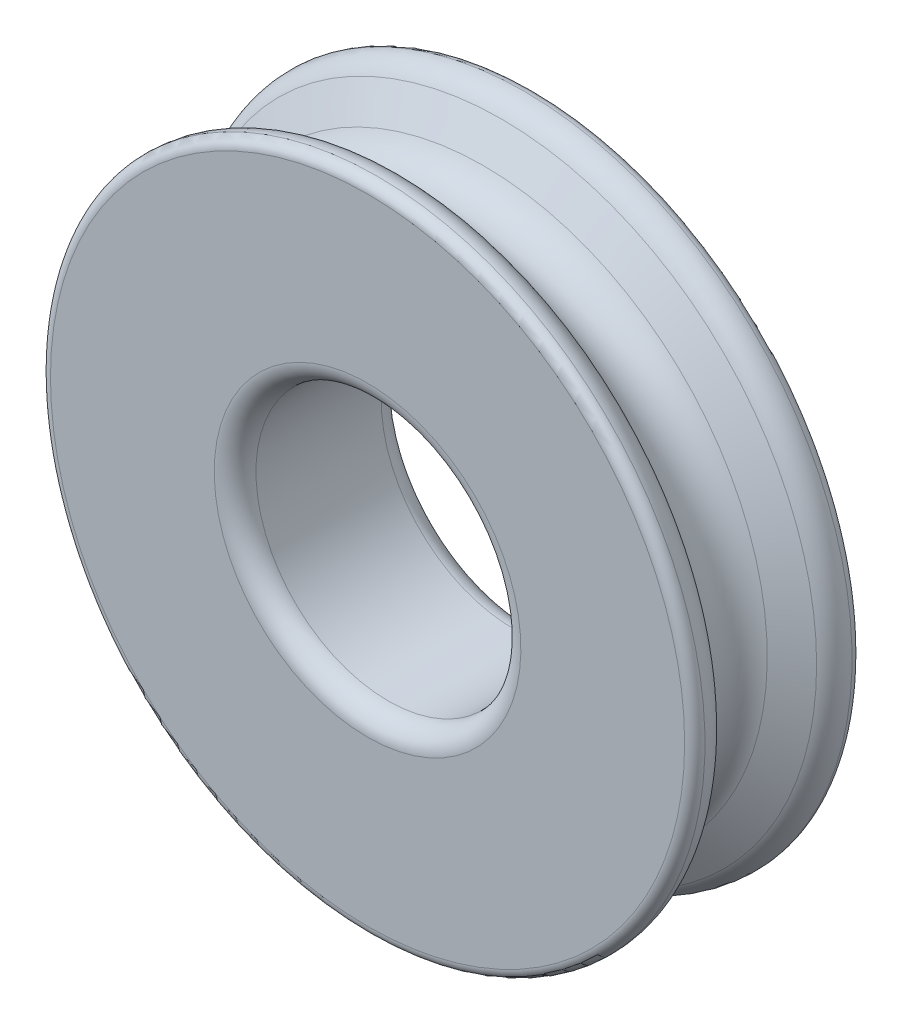
ISO-10303-21;
HEADER;
FILE_DESCRIPTION(('STEP AP214'),'2;1');
FILE_NAME('part.step','',(''),(''),'','','');
FILE_SCHEMA(('AUTOMOTIVE_DESIGN { 1 0 10303 214 1 1 1 1 }'));
ENDSEC;
DATA;
#1=APPLICATION_CONTEXT('core data for automotive mechanical design processes');
#2=APPLICATION_PROTOCOL_DEFINITION('international standard','automotive_design',2000,#1);
#3=PRODUCT_CONTEXT('',#1,'mechanical');
#4=PRODUCT('Part','Part','',(#3));
#5=PRODUCT_RELATED_PRODUCT_CATEGORY('part','',(#4));
#6=PRODUCT_DEFINITION_FORMATION('','',#4);
#7=PRODUCT_DEFINITION_CONTEXT('part definition',#1,'design');
#8=PRODUCT_DEFINITION('design','',#6,#7);
#9=PRODUCT_DEFINITION_SHAPE('','',#8);
#10=(LENGTH_UNIT() NAMED_UNIT(*) SI_UNIT(.MILLI.,.METRE.));
#11=(NAMED_UNIT(*) PLANE_ANGLE_UNIT() SI_UNIT($,.RADIAN.));
#12=(NAMED_UNIT(*) SI_UNIT($,.STERADIAN.) SOLID_ANGLE_UNIT());
#13=UNCERTAINTY_MEASURE_WITH_UNIT(LENGTH_MEASURE(1.E-05),#10,'distance_accuracy_value','');
#14=(GEOMETRIC_REPRESENTATION_CONTEXT(3) GLOBAL_UNCERTAINTY_ASSIGNED_CONTEXT((#13)) GLOBAL_UNIT_ASSIGNED_CONTEXT((#10,
#11,#12)) REPRESENTATION_CONTEXT('',''));
#15=CARTESIAN_POINT('',(0.,0.,0.));
#16=DIRECTION('',(0.,0.,1.));
#17=DIRECTION('',(1.,0.,0.));
#18=AXIS2_PLACEMENT_3D('',#15,#16,#17);
#19=CARTESIAN_POINT('',(0.,0.,-3.5000057));
#20=DIRECTION('',(0.,0.,-1.));
#21=DIRECTION('',(0.,1.,0.));
#22=AXIS2_PLACEMENT_3D('',#19,#20,#21);
#23=TOROIDAL_SURFACE('',#22,15.2006219074877,0.499999000000001);
#24=CARTESIAN_POINT('',(0.,0.,-3.52503594612087));
#25=DIRECTION('',(0.,0.,-1.));
#26=DIRECTION('',(0.,1.,0.));
#27=AXIS2_PLACEMENT_3D('',#24,#25,#26);
#28=CIRCLE('',#27,15.699994);
#29=CARTESIAN_POINT('',(0.,15.699994,-3.52503594612087));
#30=VERTEX_POINT('',#29);
#31=EDGE_CURVE('E53',#30,#30,#28,.T.);
#32=ORIENTED_EDGE('',*,*,#31,.T.);
#33=EDGE_LOOP('',(#32));
#34=FACE_BOUND('',#33,.T.);
#35=CARTESIAN_POINT('',(0.,0.,-4.0000047));
#36=DIRECTION('',(0.,0.,-1.));
#37=DIRECTION('',(0.,1.,0.));
#38=AXIS2_PLACEMENT_3D('',#35,#36,#37);
#39=CIRCLE('',#38,15.2006219074877);
#40=CARTESIAN_POINT('',(0.,15.2006219074877,-4.0000047));
#41=VERTEX_POINT('',#40);
#42=EDGE_CURVE('E74',#41,#41,#39,.T.);
#43=ORIENTED_EDGE('',*,*,#42,.F.);
#44=EDGE_LOOP('',(#43));
#45=FACE_BOUND('',#44,.T.);
#46=ADVANCED_FACE('F33',(#34,#45),#23,.T.);
#47=CARTESIAN_POINT('',(0.,0.,-3.46496335543078));
#48=DIRECTION('',(0.,0.,-1.));
#49=DIRECTION('',(0.,1.,0.));
#50=AXIS2_PLACEMENT_3D('',#47,#48,#49);
#51=TOROIDAL_SURFACE('',#50,14.5015009779704,1.1999976);
#52=CARTESIAN_POINT('',(0.,0.,-2.42573494935043));
#53=DIRECTION('',(0.,0.,-1.));
#54=DIRECTION('',(0.,1.,0.));
#55=AXIS2_PLACEMENT_3D('',#52,#53,#54);
#56=CIRCLE('',#55,15.1014997779704);
#57=CARTESIAN_POINT('',(0.,15.1014997779704,-2.42573494935042));
#58=VERTEX_POINT('',#57);
#59=EDGE_CURVE('E56',#58,#58,#56,.T.);
#60=ORIENTED_EDGE('',*,*,#59,.T.);
#61=EDGE_LOOP('',(#60));
#62=FACE_BOUND('',#61,.T.);
#63=ORIENTED_EDGE('',*,*,#31,.F.);
#64=EDGE_LOOP('',(#63));
#65=FACE_BOUND('',#64,.T.);
#66=ADVANCED_FACE('F81',(#62,#65),#51,.T.);
#67=CARTESIAN_POINT('',(0.,0.,-2.42573494935043));
#68=DIRECTION('',(0.,0.,-1.));
#69=DIRECTION('',(0.,1.,0.));
#70=AXIS2_PLACEMENT_3D('',#67,#68,#69);
#71=CONICAL_SURFACE('',#70,15.1014997779704,1.0471975511966);
#72=CARTESIAN_POINT('',(0.,0.,-1.55884260912054));
#73=DIRECTION('',(0.,0.,-1.));
#74=DIRECTION('',(0.,1.,0.));
#75=AXIS2_PLACEMENT_3D('',#72,#73,#74);
#76=CIRCLE('',#75,13.5999982);
#77=CARTESIAN_POINT('',(0.,13.5999982,-1.55884260912053));
#78=VERTEX_POINT('',#77);
#79=EDGE_CURVE('E59',#78,#78,#76,.T.);
#80=ORIENTED_EDGE('',*,*,#79,.T.);
#81=EDGE_LOOP('',(#80));
#82=FACE_BOUND('',#81,.T.);
#83=ORIENTED_EDGE('',*,*,#59,.F.);
#84=EDGE_LOOP('',(#83));
#85=FACE_BOUND('',#84,.T.);
#86=ADVANCED_FACE('F87',(#82,#85),#71,.T.);
#87=CARTESIAN_POINT('',(0.,0.,0.));
#88=DIRECTION('',(0.,0.,-1.));
#89=DIRECTION('',(0.,1.,0.));
#90=AXIS2_PLACEMENT_3D('',#87,#88,#89);
#91=TOROIDAL_SURFACE('',#90,14.4999964,1.7999964);
#92=CARTESIAN_POINT('',(0.,0.,1.55884260912053));
#93=DIRECTION('',(0.,0.,-1.));
#94=DIRECTION('',(0.,1.,0.));
#95=AXIS2_PLACEMENT_3D('',#92,#93,#94);
#96=CIRCLE('',#95,13.5999982);
#97=CARTESIAN_POINT('',(0.,13.5999982,1.55884260912053));
#98=VERTEX_POINT('',#97);
#99=EDGE_CURVE('E62',#98,#98,#96,.T.);
#100=ORIENTED_EDGE('',*,*,#99,.T.);
#101=EDGE_LOOP('',(#100));
#102=FACE_BOUND('',#101,.T.);
#103=ORIENTED_EDGE('',*,*,#79,.F.);
#104=EDGE_LOOP('',(#103));
#105=FACE_BOUND('',#104,.T.);
#106=ADVANCED_FACE('F123',(#102,#105),#91,.F.);
#107=CARTESIAN_POINT('',(0.,0.,1.55884260912053));
#108=DIRECTION('',(0.,0.,1.));
#109=DIRECTION('',(0.,-1.,0.));
#110=AXIS2_PLACEMENT_3D('',#107,#108,#109);
#111=CONICAL_SURFACE('',#110,13.5999982,1.0471975511966);
#112=CARTESIAN_POINT('',(0.,0.,2.42573494935042));
#113=DIRECTION('',(0.,0.,-1.));
#114=DIRECTION('',(0.,1.,0.));
#115=AXIS2_PLACEMENT_3D('',#112,#113,#114);
#116=CIRCLE('',#115,15.1014997779704);
#117=CARTESIAN_POINT('',(0.,15.1014997779704,2.42573494935042));
#118=VERTEX_POINT('',#117);
#119=EDGE_CURVE('E65',#118,#118,#116,.T.);
#120=ORIENTED_EDGE('',*,*,#119,.T.);
#121=EDGE_LOOP('',(#120));
#122=FACE_BOUND('',#121,.T.);
#123=ORIENTED_EDGE('',*,*,#99,.F.);
#124=EDGE_LOOP('',(#123));
#125=FACE_BOUND('',#124,.T.);
#126=ADVANCED_FACE('F119',(#122,#125),#111,.T.);
#127=CARTESIAN_POINT('',(0.,0.,3.46496335543078));
#128=DIRECTION('',(0.,0.,-1.));
#129=DIRECTION('',(0.,1.,0.));
#130=AXIS2_PLACEMENT_3D('',#127,#128,#129);
#131=TOROIDAL_SURFACE('',#130,14.5015009779704,1.1999976);
#132=CARTESIAN_POINT('',(0.,0.,3.52503594612087));
#133=DIRECTION('',(0.,0.,-1.));
#134=DIRECTION('',(0.,1.,0.));
#135=AXIS2_PLACEMENT_3D('',#132,#133,#134);
#136=CIRCLE('',#135,15.699994);
#137=CARTESIAN_POINT('',(0.,15.699994,3.52503594612087));
#138=VERTEX_POINT('',#137);
#139=EDGE_CURVE('E68',#138,#138,#136,.T.);
#140=ORIENTED_EDGE('',*,*,#139,.T.);
#141=EDGE_LOOP('',(#140));
#142=FACE_BOUND('',#141,.T.);
#143=ORIENTED_EDGE('',*,*,#119,.F.);
#144=EDGE_LOOP('',(#143));
#145=FACE_BOUND('',#144,.T.);
#146=ADVANCED_FACE('F115',(#142,#145),#131,.T.);
#147=CARTESIAN_POINT('',(0.,0.,3.5000057));
#148=DIRECTION('',(0.,0.,-1.));
#149=DIRECTION('',(0.,1.,0.));
#150=AXIS2_PLACEMENT_3D('',#147,#148,#149);
#151=TOROIDAL_SURFACE('',#150,15.2006219074877,0.499999000000001);
#152=CARTESIAN_POINT('',(0.,0.,4.0000047));
#153=DIRECTION('',(0.,0.,-1.));
#154=DIRECTION('',(0.,1.,0.));
#155=AXIS2_PLACEMENT_3D('',#152,#153,#154);
#156=CIRCLE('',#155,15.2006219074877);
#157=CARTESIAN_POINT('',(0.,15.2006219074877,4.0000047));
#158=VERTEX_POINT('',#157);
#159=EDGE_CURVE('E71',#158,#158,#156,.T.);
#160=ORIENTED_EDGE('',*,*,#159,.T.);
#161=EDGE_LOOP('',(#160));
#162=FACE_BOUND('',#161,.T.);
#163=ORIENTED_EDGE('',*,*,#139,.F.);
#164=EDGE_LOOP('',(#163));
#165=FACE_BOUND('',#164,.T.);
#166=ADVANCED_FACE('F110',(#162,#165),#151,.T.);
#167=CARTESIAN_POINT('',(0.,0.,4.0000047));
#168=DIRECTION('',(0.,0.,1.));
#169=DIRECTION('',(0.,-1.,0.));
#170=AXIS2_PLACEMENT_3D('',#167,#168,#169);
#171=PLANE('',#170);
#172=CARTESIAN_POINT('',(0.,0.,4.0000047));
#173=DIRECTION('',(0.,0.,1.));
#174=DIRECTION('',(0.,-1.,0.));
#175=AXIS2_PLACEMENT_3D('',#172,#173,#174);
#176=CIRCLE('',#175,7.35);
#177=CARTESIAN_POINT('',(0.,-7.35,4.0000047));
#178=VERTEX_POINT('',#177);
#179=EDGE_CURVE('E10',#178,#178,#176,.F.);
#180=ORIENTED_EDGE('',*,*,#179,.T.);
#181=EDGE_LOOP('',(#180));
#182=FACE_BOUND('',#181,.T.);
#183=ORIENTED_EDGE('',*,*,#159,.F.);
#184=EDGE_LOOP('',(#183));
#185=FACE_BOUND('',#184,.T.);
#186=ADVANCED_FACE('F105',(#182,#185),#171,.T.);
#187=CARTESIAN_POINT('',(0.,0.,-4.0000047));
#188=DIRECTION('',(0.,0.,-1.));
#189=DIRECTION('',(0.,1.,0.));
#190=AXIS2_PLACEMENT_3D('',#187,#188,#189);
#191=PLANE('',#190);
#192=CARTESIAN_POINT('',(0.,0.,-4.0000047));
#193=DIRECTION('',(0.,0.,-1.));
#194=DIRECTION('',(0.,1.,0.));
#195=AXIS2_PLACEMENT_3D('',#192,#193,#194);
#196=CIRCLE('',#195,7.35);
#197=CARTESIAN_POINT('',(0.,7.35,-4.0000047));
#198=VERTEX_POINT('',#197);
#199=EDGE_CURVE('E48',#198,#198,#196,.F.);
#200=ORIENTED_EDGE('',*,*,#199,.T.);
#201=EDGE_LOOP('',(#200));
#202=FACE_BOUND('',#201,.T.);
#203=ORIENTED_EDGE('',*,*,#42,.T.);
#204=EDGE_LOOP('',(#203));
#205=FACE_BOUND('',#204,.T.);
#206=ADVANCED_FACE('F78',(#202,#205),#191,.T.);
#207=CARTESIAN_POINT('',(0.,0.,-4.0000047));
#208=DIRECTION('',(0.,0.,1.));
#209=DIRECTION('',(1.,0.,0.));
#210=AXIS2_PLACEMENT_3D('',#207,#208,#209);
#211=CYLINDRICAL_SURFACE('',#210,6.35);
#212=CARTESIAN_POINT('',(0.,0.,-3.0000047));
#213=DIRECTION('',(0.,0.,-1.));
#214=DIRECTION('',(0.,1.,0.));
#215=AXIS2_PLACEMENT_3D('',#212,#213,#214);
#216=CIRCLE('',#215,6.35);
#217=CARTESIAN_POINT('',(0.,6.35,-3.0000047));
#218=VERTEX_POINT('',#217);
#219=EDGE_CURVE('E40',#218,#218,#216,.T.);
#220=ORIENTED_EDGE('',*,*,#219,.T.);
#221=EDGE_LOOP('',(#220));
#222=FACE_BOUND('',#221,.T.);
#223=CARTESIAN_POINT('',(0.,0.,3.0000047));
#224=DIRECTION('',(0.,0.,1.));
#225=DIRECTION('',(0.,-1.,0.));
#226=AXIS2_PLACEMENT_3D('',#223,#224,#225);
#227=CIRCLE('',#226,6.35);
#228=CARTESIAN_POINT('',(0.,-6.35,3.0000047));
#229=VERTEX_POINT('',#228);
#230=EDGE_CURVE('E44',#229,#229,#227,.T.);
#231=ORIENTED_EDGE('',*,*,#230,.T.);
#232=EDGE_LOOP('',(#231));
#233=FACE_BOUND('',#232,.T.);
#234=ADVANCED_FACE('F93',(#222,#233),#211,.F.);
#235=CARTESIAN_POINT('',(0.,0.,-3.0000047));
#236=DIRECTION('',(0.,0.,-1.));
#237=DIRECTION('',(0.,1.,0.));
#238=AXIS2_PLACEMENT_3D('',#235,#236,#237);
#239=TOROIDAL_SURFACE('',#238,7.35,1.);
#240=ORIENTED_EDGE('',*,*,#219,.F.);
#241=EDGE_LOOP('',(#240));
#242=FACE_BOUND('',#241,.T.);
#243=ORIENTED_EDGE('',*,*,#199,.F.);
#244=EDGE_LOOP('',(#243));
#245=FACE_BOUND('',#244,.T.);
#246=ADVANCED_FACE('F91',(#242,#245),#239,.T.);
#247=CARTESIAN_POINT('',(0.,0.,3.0000047));
#248=DIRECTION('',(0.,0.,1.));
#249=DIRECTION('',(0.,-1.,0.));
#250=AXIS2_PLACEMENT_3D('',#247,#248,#249);
#251=TOROIDAL_SURFACE('',#250,7.35,1.);
#252=ORIENTED_EDGE('',*,*,#179,.F.);
#253=EDGE_LOOP('',(#252));
#254=FACE_BOUND('',#253,.T.);
#255=ORIENTED_EDGE('',*,*,#230,.F.);
#256=EDGE_LOOP('',(#255));
#257=FACE_BOUND('',#256,.T.);
#258=ADVANCED_FACE('F35',(#254,#257),#251,.T.);
#259=CLOSED_SHELL('',(#46,#66,#86,#106,#126,#146,#166,#186,#206,#234,#246,#258));
#260=MANIFOLD_SOLID_BREP('B2',#259);
#261=ADVANCED_BREP_SHAPE_REPRESENTATION('',(#18,#260),#14);
#262=SHAPE_DEFINITION_REPRESENTATION(#9,#261);
ENDSEC;
END-ISO-10303-21;
